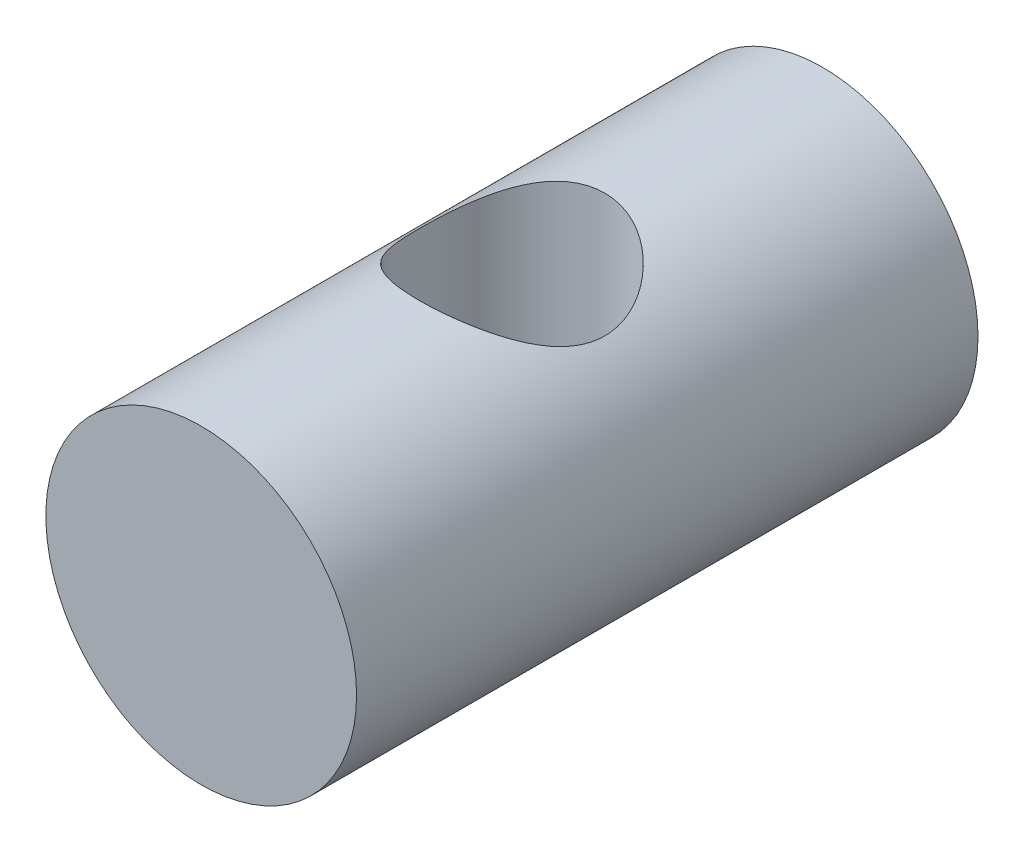
ISO-10303-21;
HEADER;
FILE_DESCRIPTION(('STEP AP214'),'2;1');
FILE_NAME('part.step','',(''),(''),'','','');
FILE_SCHEMA(('AUTOMOTIVE_DESIGN { 1 0 10303 214 1 1 1 1 }'));
ENDSEC;
DATA;
#1=APPLICATION_CONTEXT('core data for automotive mechanical design processes');
#2=APPLICATION_PROTOCOL_DEFINITION('international standard','automotive_design',2000,#1);
#3=PRODUCT_CONTEXT('',#1,'mechanical');
#4=PRODUCT('Part','Part','',(#3));
#5=PRODUCT_RELATED_PRODUCT_CATEGORY('part','',(#4));
#6=PRODUCT_DEFINITION_FORMATION('','',#4);
#7=PRODUCT_DEFINITION_CONTEXT('part definition',#1,'design');
#8=PRODUCT_DEFINITION('design','',#6,#7);
#9=PRODUCT_DEFINITION_SHAPE('','',#8);
#10=(LENGTH_UNIT() NAMED_UNIT(*) SI_UNIT(.MILLI.,.METRE.));
#11=(NAMED_UNIT(*) PLANE_ANGLE_UNIT() SI_UNIT($,.RADIAN.));
#12=(NAMED_UNIT(*) SI_UNIT($,.STERADIAN.) SOLID_ANGLE_UNIT());
#13=UNCERTAINTY_MEASURE_WITH_UNIT(LENGTH_MEASURE(1.E-05),#10,'distance_accuracy_value','');
#14=(GEOMETRIC_REPRESENTATION_CONTEXT(3) GLOBAL_UNCERTAINTY_ASSIGNED_CONTEXT((#13)) GLOBAL_UNIT_ASSIGNED_CONTEXT((#10,
#11,#12)) REPRESENTATION_CONTEXT('',''));
#15=CARTESIAN_POINT('',(0.,0.,0.));
#16=DIRECTION('',(0.,0.,1.));
#17=DIRECTION('',(1.,0.,0.));
#18=AXIS2_PLACEMENT_3D('',#15,#16,#17);
#19=CARTESIAN_POINT('',(0.,0.,12.7000000000003));
#20=DIRECTION('',(0.,0.,-1.));
#21=DIRECTION('',(-1.,0.,0.));
#22=AXIS2_PLACEMENT_3D('',#19,#20,#21);
#23=CYLINDRICAL_SURFACE('',#22,3.175);
#24=CARTESIAN_POINT('',(0.,-3.17499999999986,8.24865000000027));
#25=CARTESIAN_POINT('',(0.0971721695041155,-3.17499473733426,8.24864419202765));
#26=CARTESIAN_POINT('',(0.19450577217167,-3.17048993511671,8.24113733732861));
#27=CARTESIAN_POINT('',(0.386247876195191,-3.15289724444995,8.21149009995272));
#28=CARTESIAN_POINT('',(0.480648418145989,-3.13978783032965,8.18931301650262));
#29=CARTESIAN_POINT('',(0.663338202960554,-3.10631453914748,8.13156838589002));
#30=CARTESIAN_POINT('',(0.751655205087018,-3.08598663827957,8.09606719563707));
#31=CARTESIAN_POINT('',(0.920802871190091,-3.03980996111724,8.01309271078769));
#32=CARTESIAN_POINT('',(1.00163547058609,-3.01396261786412,7.96562252318666));
#33=CARTESIAN_POINT('',(1.16049252060856,-2.95661027604283,7.85603414898813));
#34=CARTESIAN_POINT('',(1.23783381861572,-2.92482426540904,7.79307550488859));
#35=CARTESIAN_POINT('',(1.38152642634448,-2.8597631829878,7.65618607422837));
#36=CARTESIAN_POINT('',(1.44786347487472,-2.82648624881519,7.58224128145894));
#37=CARTESIAN_POINT('',(1.57584554094787,-2.75739691062358,7.41489132383026));
#38=CARTESIAN_POINT('',(1.6359388108927,-2.72176832488566,7.32021314558746));
#39=CARTESIAN_POINT('',(1.73913402629436,-2.65702180796895,7.1200083287993));
#40=CARTESIAN_POINT('',(1.78226344099677,-2.6278933845754,7.01449958032126));
#41=CARTESIAN_POINT('',(1.84124574883961,-2.58677571161611,6.82146936680268));
#42=CARTESIAN_POINT('',(1.86116114936045,-2.57235066712383,6.73571022830315));
#43=CARTESIAN_POINT('',(1.8889128720029,-2.55204635151919,6.56130917997803));
#44=CARTESIAN_POINT('',(1.8967640575195,-2.5461565652793,6.4726709550315));
#45=CARTESIAN_POINT('',(1.89993521562889,-2.54379182699524,6.29487125063821));
#46=CARTESIAN_POINT('',(1.89523118653508,-2.54733490764218,6.2057090945724));
#47=CARTESIAN_POINT('',(1.87353957703242,-2.56332717440687,6.02968974498448));
#48=CARTESIAN_POINT('',(1.85654281014562,-2.57578302104396,5.94283432566224));
#49=CARTESIAN_POINT('',(1.81144682058195,-2.60768613385452,5.77464836949031));
#50=CARTESIAN_POINT('',(1.78348568689043,-2.62704618159414,5.6932633243454));
#51=CARTESIAN_POINT('',(1.71748307414508,-2.67066254406482,5.53612284763965));
#52=CARTESIAN_POINT('',(1.67943788818217,-2.69492065854803,5.46036949943641));
#53=CARTESIAN_POINT('',(1.5867241402079,-2.75069759525309,5.30265162279249));
#54=CARTESIAN_POINT('',(1.5303155322787,-2.78274553828706,5.22189649820792));
#55=CARTESIAN_POINT('',(1.40589250511386,-2.84763476747706,5.07016461744665));
#56=CARTESIAN_POINT('',(1.33786706770615,-2.88047678116012,4.9991972612278));
#57=CARTESIAN_POINT('',(1.18101849252234,-2.94857405920872,4.85916879537567));
#58=CARTESIAN_POINT('',(1.09062187934172,-2.98354055000547,4.79171047311204));
#59=CARTESIAN_POINT('',(0.897655771105356,-3.04715194844807,4.67313276097033));
#60=CARTESIAN_POINT('',(0.795092934616693,-3.07580028968888,4.62200448972938));
#61=CARTESIAN_POINT('',(0.587246926940607,-3.12191592586988,4.54123448919887));
#62=CARTESIAN_POINT('',(0.482552010341167,-3.13997863496473,4.51043266782496));
#63=CARTESIAN_POINT('',(0.268218469351438,-3.16548279140974,4.46722518499046));
#64=CARTESIAN_POINT('',(0.158585853436762,-3.17293680604299,4.45479775615735));
#65=CARTESIAN_POINT('',(-0.0464594408306258,-3.17608971445387,4.4495299351384));
#66=CARTESIAN_POINT('',(-0.141797439375071,-3.17323736279411,4.45427567703367));
#67=CARTESIAN_POINT('',(-0.330075000877293,-3.15920579927552,4.47785706276718));
#68=CARTESIAN_POINT('',(-0.4230146049282,-3.14802673018146,4.49669246503281));
#69=CARTESIAN_POINT('',(-0.601841757346943,-3.11872468347463,4.54692120740759));
#70=CARTESIAN_POINT('',(-0.687842979442267,-3.10076906658595,4.57801262437611));
#71=CARTESIAN_POINT('',(-0.853395669196919,-3.0593513406723,4.65153052947891));
#72=CARTESIAN_POINT('',(-0.932945842775165,-3.0358881304818,4.69395928458889));
#73=CARTESIAN_POINT('',(-1.09227149435592,-2.98250562345754,4.79386561707399));
#74=CARTESIAN_POINT('',(-1.17121199585699,-2.95216886588652,4.85244859631543));
#75=CARTESIAN_POINT('',(-1.31874135614905,-2.88928920038506,4.9805635024794));
#76=CARTESIAN_POINT('',(-1.38731797014924,-2.85674374765854,5.05010818544457));
#77=CARTESIAN_POINT('',(-1.52127553416574,-2.78795863350621,5.2086358568967));
#78=CARTESIAN_POINT('',(-1.58510202260854,-2.75178424164376,5.29896916783537));
#79=CARTESIAN_POINT('',(-1.69670447642641,-2.68441351776571,5.49073413933667));
#80=CARTESIAN_POINT('',(-1.74449774143377,-2.65321183947181,5.59215368027196));
#81=CARTESIAN_POINT('',(-1.81359870059373,-2.60630783041172,5.78118413318859));
#82=CARTESIAN_POINT('',(-1.83839773989268,-2.58871328079627,5.86704431366762));
#83=CARTESIAN_POINT('',(-1.87574133757367,-2.56178872180508,6.04260243510432));
#84=CARTESIAN_POINT('',(-1.8883026845437,-2.5524473916852,6.13229494163827));
#85=CARTESIAN_POINT('',(-1.90047164452551,-2.54340279632301,6.31338941264418));
#86=CARTESIAN_POINT('',(-1.90003234357788,-2.54373443676726,6.40479637834196));
#87=CARTESIAN_POINT('',(-1.88611100257854,-2.55407083156861,6.58607448834084));
#88=CARTESIAN_POINT('',(-1.87262173314416,-2.56408094757698,6.67594475326061));
#89=CARTESIAN_POINT('',(-1.83431553008198,-2.59160705495956,6.84753513731629));
#90=CARTESIAN_POINT('',(-1.81004575678653,-2.60875824095106,6.92944001728835));
#91=CARTESIAN_POINT('',(-1.7513568659853,-2.64851399533432,7.08809505053896));
#92=CARTESIAN_POINT('',(-1.71693393424813,-2.6711206125835,7.16484325328386));
#93=CARTESIAN_POINT('',(-1.63283008968824,-2.72347195098667,7.32365712195493));
#94=CARTESIAN_POINT('',(-1.58161638925417,-2.75377977993814,7.40472374581691));
#95=CARTESIAN_POINT('',(-1.46796619901484,-2.81600891017818,7.5579148349012));
#96=CARTESIAN_POINT('',(-1.40552049819924,-2.84793152013768,7.63003187820528));
#97=CARTESIAN_POINT('',(-1.25938084169041,-2.9158293815611,7.77515182177759));
#98=CARTESIAN_POINT('',(-1.17388519683463,-2.95163294738108,7.84643986719742));
#99=CARTESIAN_POINT('',(-0.990349204787536,-3.01817353695173,7.973748708468));
#100=CARTESIAN_POINT('',(-0.89230459426743,-3.04890883067209,8.02976429538402));
#101=CARTESIAN_POINT('',(-0.689127454969017,-3.1010170838544,8.12256494572291));
#102=CARTESIAN_POINT('',(-0.584333119665086,-3.122664186268,8.15992077045773));
#103=CARTESIAN_POINT('',(-0.422603642020569,-3.14722498197885,8.20186117466459));
#104=CARTESIAN_POINT('',(-0.367997826631762,-3.15409049809301,8.21348752951459));
#105=CARTESIAN_POINT('',(-0.257714777878189,-3.16500625364522,8.23190577998007));
#106=CARTESIAN_POINT('',(-0.20203848528169,-3.16905885848789,8.23870173763966));
#107=CARTESIAN_POINT('',(-0.121834464996306,-3.17275503945502,8.24489393476531));
#108=CARTESIAN_POINT('',(-0.0974978003971335,-3.17359593319016,8.2463014262942));
#109=CARTESIAN_POINT('',(-0.0487774826500979,-3.17471908275571,8.24818020255186));
#110=CARTESIAN_POINT('',(-0.0243938280573461,-3.17500132112463,8.24865145801738));
#111=CARTESIAN_POINT('',(0.,-3.17499999999986,8.24865000000027));
#112=B_SPLINE_CURVE_WITH_KNOTS('',3,(#24,#25,#26,#27,#28,#29,#30,#31,#32,#33,#34,#35,#36,#37,
#38,#39,#40,#41,#42,#43,#44,#45,#46,#47,#48,#49,#50,#51,#52,#53,#54,#55,#56,#57,#58,#59,#60,#61,
#62,#63,#64,#65,#66,#67,#68,#69,#70,#71,#72,#73,#74,#75,#76,#77,#78,#79,#80,#81,#82,#83,#84,#85,
#86,#87,#88,#89,#90,#91,#92,#93,#94,#95,#96,#97,#98,#99,#100,#101,#102,#103,#104,#105,#106,#107,
#108,#109,#110,#111),.UNSPECIFIED.,.T.,.F.,(4,2,2,2,2,2,2,2,2,2,2,2,2,2,2,2,2,2,2,2,2,2,2,2,2,2,
2,2,2,2,2,2,2,2,2,2,2,2,2,2,2,2,2,4),(0.,0.291416779287842,0.583565372317145,0.87427790379868,
1.16491504765877,1.47769532259325,1.79087783742578,2.14214785566549,2.49284670402168,
2.75935667027434,3.02553802600596,3.29222860244387,3.55911868544988,3.82275017836236,
4.0864787172411,4.39605203096694,4.70592061211431,5.05838095995919,5.41064928882309,
5.74050489129687,6.06996941369503,6.35503525304075,6.64009620493542,6.91853438364003,
7.1970282796161,7.5044512822628,7.81223470820542,8.15973748058226,8.50686408703154,
8.77899324108156,9.05074853994615,9.32348461042399,9.59637185698685,9.85675961477027,
10.1172453171383,10.4178141100819,10.718630523267,11.0677182661433,11.4169249228813,
11.7546716756256,11.92318780502,12.0915620553098,12.1647162172466,12.2378726656744),.UNSPECIFIED.);
#113=CARTESIAN_POINT('',(0.,-3.17499999999986,8.24865000000027));
#114=VERTEX_POINT('',#113);
#115=EDGE_CURVE('E10',#114,#114,#112,.T.);
#116=ORIENTED_EDGE('',*,*,#115,.T.);
#117=EDGE_LOOP('',(#116));
#118=FACE_BOUND('',#117,.T.);
#119=CARTESIAN_POINT('',(-1.2490009027033E-13,3.17500000000008,8.24865000000027));
#120=CARTESIAN_POINT('',(-0.0971721695042668,3.17499473733458,8.24864419202765));
#121=CARTESIAN_POINT('',(-0.194505772171796,3.17048993511689,8.24113733732865));
#122=CARTESIAN_POINT('',(-0.386247876195254,3.15289724445005,8.21149009995273));
#123=CARTESIAN_POINT('',(-0.480648418146015,3.1397878303298,8.18931301650259));
#124=CARTESIAN_POINT('',(-0.663338202960586,3.10631453914768,8.13156838589004));
#125=CARTESIAN_POINT('',(-0.751655205087093,3.08598663827976,8.09606719563717));
#126=CARTESIAN_POINT('',(-0.920802871190146,3.03980996111735,8.01309271078777));
#127=CARTESIAN_POINT('',(-1.00163547058608,3.01396261786417,7.96562252318666));
#128=CARTESIAN_POINT('',(-1.16049252060858,2.95661027604286,7.85603414898812));
#129=CARTESIAN_POINT('',(-1.23783381861585,2.92482426540911,7.79307550488867));
#130=CARTESIAN_POINT('',(-1.38152642634466,2.85976318298795,7.65618607422846));
#131=CARTESIAN_POINT('',(-1.44786347487484,2.82648624881538,7.58224128145895));
#132=CARTESIAN_POINT('',(-1.57584554094801,2.75739691062372,7.41489132383027));
#133=CARTESIAN_POINT('',(-1.63593881089294,2.7217683248857,7.32021314558757));
#134=CARTESIAN_POINT('',(-1.73913402629451,2.65702180796906,7.1200083287994));
#135=CARTESIAN_POINT('',(-1.78226344099673,2.62789338457571,7.01449958032125));
#136=CARTESIAN_POINT('',(-1.84124574883967,2.58677571161631,6.82146936680267));
#137=CARTESIAN_POINT('',(-1.86116114936069,2.57235066712385,6.7357102283032));
#138=CARTESIAN_POINT('',(-1.88891287200314,2.55204635151924,6.5613091799781));
#139=CARTESIAN_POINT('',(-1.89676405751954,2.54615656527957,6.47267095503153));
#140=CARTESIAN_POINT('',(-1.89993521562895,2.54379182699553,6.29487125063819));
#141=CARTESIAN_POINT('',(-1.89523118653534,2.54733490764227,6.20570909457235));
#142=CARTESIAN_POINT('',(-1.87353957703265,2.56332717440685,6.02968974498445));
#143=CARTESIAN_POINT('',(-1.8565428101456,2.57578302104403,5.94283432566226));
#144=CARTESIAN_POINT('',(-1.8114468205819,2.60768613385462,5.7746483694903));
#145=CARTESIAN_POINT('',(-1.78348568689059,2.62704618159419,5.6932633243453));
#146=CARTESIAN_POINT('',(-1.71748307414534,2.67066254406491,5.53612284763956));
#147=CARTESIAN_POINT('',(-1.6794378881823,2.6949206585482,5.46036949943641));
#148=CARTESIAN_POINT('',(-1.58672414020796,2.75069759525329,5.3026516227925));
#149=CARTESIAN_POINT('',(-1.53031553227886,2.78274553828717,5.22189649820782));
#150=CARTESIAN_POINT('',(-1.40589250511403,2.84763476747715,5.07016461744655));
#151=CARTESIAN_POINT('',(-1.33786706770623,2.88047678116027,4.99919726122779));
#152=CARTESIAN_POINT('',(-1.18101849252237,2.94857405920891,4.85916879537568));
#153=CARTESIAN_POINT('',(-1.09062187934182,2.98354055000563,4.79171047311194));
#154=CARTESIAN_POINT('',(-0.897655771105457,3.04715194844819,4.67313276097024));
#155=CARTESIAN_POINT('',(-0.795092934616728,3.07580028968896,4.62200448972939));
#156=CARTESIAN_POINT('',(-0.587246926940627,3.12191592586998,4.54123448919892));
#157=CARTESIAN_POINT('',(-0.482552010341231,3.13997863496487,4.51043266782493));
#158=CARTESIAN_POINT('',(-0.268218469351544,3.16548279140988,4.46722518499042));
#159=CARTESIAN_POINT('',(-0.158585853436865,3.1729368060431,4.45479775615737));
#160=CARTESIAN_POINT('',(0.0464594408305158,3.17608971445395,4.44952993513844));
#161=CARTESIAN_POINT('',(0.141797439374954,3.1732373627942,4.45427567703368));
#162=CARTESIAN_POINT('',(0.330075000877177,3.15920579927571,4.4778570627672));
#163=CARTESIAN_POINT('',(0.423014604928092,3.14802673018174,4.49669246503285));
#164=CARTESIAN_POINT('',(0.601841757346833,3.11872468347489,4.54692120740766));
#165=CARTESIAN_POINT('',(0.687842979442147,3.10076906658611,4.57801262437618));
#166=CARTESIAN_POINT('',(0.853395669196842,3.05935134067241,4.65153052947896));
#167=CARTESIAN_POINT('',(0.93294584277514,3.03588813048198,4.69395928458893));
#168=CARTESIAN_POINT('',(1.09227149435588,2.98250562345773,4.79386561707406));
#169=CARTESIAN_POINT('',(1.17121199585688,2.95216886588666,4.85244859631556));
#170=CARTESIAN_POINT('',(1.31874135614895,2.88928920038521,4.98056350247952));
#171=CARTESIAN_POINT('',(1.38731797014921,2.85674374765875,5.05010818544463));
#172=CARTESIAN_POINT('',(1.52127553416568,2.78795863350645,5.20863585689674));
#173=CARTESIAN_POINT('',(1.58510202260835,2.75178424164396,5.29896916783547));
#174=CARTESIAN_POINT('',(1.69670447642622,2.6844135177659,5.49073413933677));
#175=CARTESIAN_POINT('',(1.7444977414337,2.65321183947203,5.592153680272));
#176=CARTESIAN_POINT('',(1.81359870059361,2.60630783041196,5.78118413318862));
#177=CARTESIAN_POINT('',(1.83839773989246,2.58871328079653,5.86704431366769));
#178=CARTESIAN_POINT('',(1.87574133757342,2.5617887218053,6.0426024351044));
#179=CARTESIAN_POINT('',(1.88830268454355,2.55244739168537,6.13229494163833));
#180=CARTESIAN_POINT('',(1.90047164452536,2.5434027963232,6.31338941264422));
#181=CARTESIAN_POINT('',(1.90003234357762,2.54373443676752,6.404796378342));
#182=CARTESIAN_POINT('',(1.88611100257829,2.55407083156886,6.58607448834089));
#183=CARTESIAN_POINT('',(1.87262173314402,2.56408094757718,6.67594475326068));
#184=CARTESIAN_POINT('',(1.83431553008183,2.59160705495975,6.84753513731632));
#185=CARTESIAN_POINT('',(1.81004575678627,2.60875824095132,6.92944001728833));
#186=CARTESIAN_POINT('',(1.75135686598507,2.64851399533454,7.08809505053896));
#187=CARTESIAN_POINT('',(1.71693393424804,2.67112061258364,7.16484325328393));
#188=CARTESIAN_POINT('',(1.63283008968819,2.72347195098678,7.32365712195496));
#189=CARTESIAN_POINT('',(1.58161638925399,2.75377977993832,7.40472374581681));
#190=CARTESIAN_POINT('',(1.46796619901468,2.81600891017836,7.5579148349011));
#191=CARTESIAN_POINT('',(1.40552049819922,2.84793152013777,7.6300318782053));
#192=CARTESIAN_POINT('',(1.25938084169045,2.91582938156116,7.77515182177765));
#193=CARTESIAN_POINT('',(1.17388519683456,2.9516329473812,7.84643986719735));
#194=CARTESIAN_POINT('',(0.990349204787376,3.0181735369519,7.97374870846789));
#195=CARTESIAN_POINT('',(0.892304594267306,3.04890883067225,8.02976429538399));
#196=CARTESIAN_POINT('',(0.689127454968902,3.10101708385455,8.12256494572293));
#197=CARTESIAN_POINT('',(0.584333119664945,3.12266418626814,8.15992077045771));
#198=CARTESIAN_POINT('',(0.422603642020414,3.147224981979,8.20186117466456));
#199=CARTESIAN_POINT('',(0.367997826631605,3.15409049809316,8.21348752951456));
#200=CARTESIAN_POINT('',(0.257714777878028,3.16500625364536,8.23190577998006));
#201=CARTESIAN_POINT('',(0.202038485281526,3.16905885848802,8.23870173763966));
#202=CARTESIAN_POINT('',(0.121834464996137,3.17275503945514,8.24489393476531));
#203=CARTESIAN_POINT('',(0.0974978003969611,3.17359593319028,8.2463014262942));
#204=CARTESIAN_POINT('',(0.048777482649921,3.17471908275587,8.24818020255186));
#205=CARTESIAN_POINT('',(0.0243938280571676,3.17500132112482,8.24865145801738));
#206=CARTESIAN_POINT('',(-1.2490009027033E-13,3.17500000000008,8.24865000000027));
#207=B_SPLINE_CURVE_WITH_KNOTS('',3,(#119,#120,#121,#122,#123,#124,#125,#126,#127,#128,#129,
#130,#131,#132,#133,#134,#135,#136,#137,#138,#139,#140,#141,#142,#143,#144,#145,#146,#147,#148,
#149,#150,#151,#152,#153,#154,#155,#156,#157,#158,#159,#160,#161,#162,#163,#164,#165,#166,#167,
#168,#169,#170,#171,#172,#173,#174,#175,#176,#177,#178,#179,#180,#181,#182,#183,#184,#185,#186,
#187,#188,#189,#190,#191,#192,#193,#194,#195,#196,#197,#198,#199,#200,#201,#202,#203,#204,#205,
#206),.UNSPECIFIED.,.T.,.F.,(4,2,2,2,2,2,2,2,2,2,2,2,2,2,2,2,2,2,2,2,2,2,2,2,2,2,2,2,2,2,2,2,2,
2,2,2,2,2,2,2,2,2,2,4),(0.,0.291416779287757,0.583565372316984,0.874277903798538,
1.16491504765865,1.47769532259317,1.79087783742574,2.14214785566541,2.49284670402159,
2.75935667027427,3.02553802600592,3.29222860244385,3.55911868544989,3.82275017836237,
4.08647871724111,4.39605203096697,4.70592061211436,5.05838095995925,5.41064928882316,
5.7405048912969,6.06996941369503,6.35503525304074,6.6400962049354,6.91853438364006,
7.19702827961618,7.50445128226286,7.81223470820546,8.15973748058226,8.5068640870315,
8.77899324108152,9.05074853994612,9.32348461042395,9.59637185698679,9.85675961477018,
10.1172453171382,10.4178141100817,10.7186305232667,11.0677182661432,11.4169249228812,
11.7546716756255,11.9231878050199,12.0915620553097,12.1647162172465,12.2378726656743),.UNSPECIFIED.);
#208=CARTESIAN_POINT('',(-1.2490009027033E-13,3.17500000000008,8.24865000000027));
#209=VERTEX_POINT('',#208);
#210=EDGE_CURVE('E47',#209,#209,#207,.T.);
#211=ORIENTED_EDGE('',*,*,#210,.T.);
#212=EDGE_LOOP('',(#211));
#213=FACE_BOUND('',#212,.T.);
#214=CARTESIAN_POINT('',(0.,0.,12.7000000000003));
#215=DIRECTION('',(0.,0.,1.));
#216=DIRECTION('',(1.,0.,0.));
#217=AXIS2_PLACEMENT_3D('',#214,#215,#216);
#218=CIRCLE('',#217,3.175);
#219=CARTESIAN_POINT('',(3.17499999999995,0.,12.7000000000003));
#220=VERTEX_POINT('',#219);
#221=EDGE_CURVE('E51',#220,#220,#218,.T.);
#222=ORIENTED_EDGE('',*,*,#221,.F.);
#223=EDGE_LOOP('',(#222));
#224=FACE_BOUND('',#223,.T.);
#225=CARTESIAN_POINT('',(0.,0.,0.));
#226=DIRECTION('',(0.,0.,1.));
#227=DIRECTION('',(1.,0.,0.));
#228=AXIS2_PLACEMENT_3D('',#225,#226,#227);
#229=CIRCLE('',#228,3.175);
#230=CARTESIAN_POINT('',(3.175,0.,0.));
#231=VERTEX_POINT('',#230);
#232=EDGE_CURVE('E55',#231,#231,#229,.T.);
#233=ORIENTED_EDGE('',*,*,#232,.T.);
#234=EDGE_LOOP('',(#233));
#235=FACE_BOUND('',#234,.T.);
#236=ADVANCED_FACE('F36',(#118,#213,#224,#235),#23,.T.);
#237=CARTESIAN_POINT('',(0.,0.,12.7000000000003));
#238=DIRECTION('',(0.,0.,1.));
#239=DIRECTION('',(1.,0.,0.));
#240=AXIS2_PLACEMENT_3D('',#237,#238,#239);
#241=PLANE('',#240);
#242=ORIENTED_EDGE('',*,*,#221,.T.);
#243=EDGE_LOOP('',(#242));
#244=FACE_BOUND('',#243,.T.);
#245=ADVANCED_FACE('F67',(#244),#241,.T.);
#246=CARTESIAN_POINT('',(0.,0.,0.));
#247=DIRECTION('',(0.,0.,1.));
#248=DIRECTION('',(1.,0.,0.));
#249=AXIS2_PLACEMENT_3D('',#246,#247,#248);
#250=PLANE('',#249);
#251=ORIENTED_EDGE('',*,*,#232,.F.);
#252=EDGE_LOOP('',(#251));
#253=FACE_BOUND('',#252,.T.);
#254=ADVANCED_FACE('F65',(#253),#250,.F.);
#255=CARTESIAN_POINT('',(-1.2490009027033E-13,3.17500000000008,6.3500000000003));
#256=DIRECTION('',(0.,1.,0.));
#257=DIRECTION('',(0.,0.,1.));
#258=AXIS2_PLACEMENT_3D('',#255,#256,#257);
#259=CYLINDRICAL_SURFACE('',#258,1.89864999999999);
#260=ORIENTED_EDGE('',*,*,#210,.F.);
#261=EDGE_LOOP('',(#260));
#262=FACE_BOUND('',#261,.T.);
#263=ORIENTED_EDGE('',*,*,#115,.F.);
#264=EDGE_LOOP('',(#263));
#265=FACE_BOUND('',#264,.T.);
#266=ADVANCED_FACE('F61',(#262,#265),#259,.F.);
#267=CLOSED_SHELL('',(#236,#245,#254,#266));
#268=MANIFOLD_SOLID_BREP('B2',#267);
#269=ADVANCED_BREP_SHAPE_REPRESENTATION('',(#18,#268),#14);
#270=SHAPE_DEFINITION_REPRESENTATION(#9,#269);
ENDSEC;
END-ISO-10303-21;
